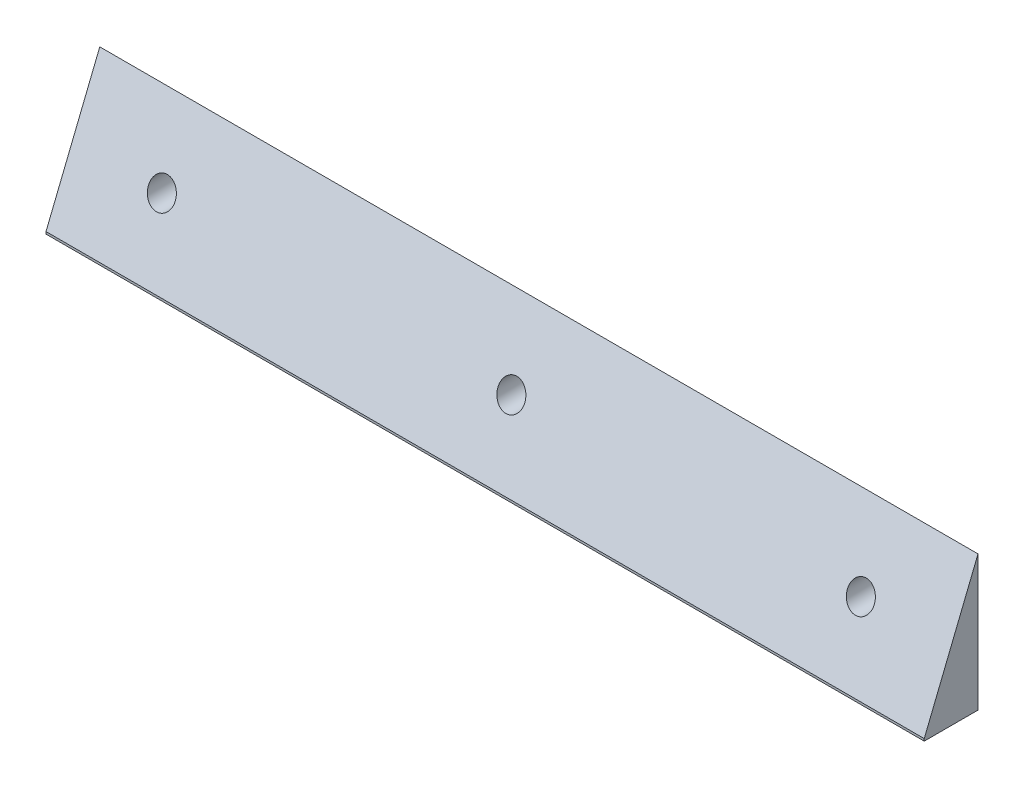
ISO-10303-21;
HEADER;
FILE_DESCRIPTION(('STEP AP214'),'2;1');
FILE_NAME('part.step','',(''),(''),'','','');
FILE_SCHEMA(('AUTOMOTIVE_DESIGN { 1 0 10303 214 1 1 1 1 }'));
ENDSEC;
DATA;
#1=APPLICATION_CONTEXT('core data for automotive mechanical design processes');
#2=APPLICATION_PROTOCOL_DEFINITION('international standard','automotive_design',2000,#1);
#3=PRODUCT_CONTEXT('',#1,'mechanical');
#4=PRODUCT('Part','Part','',(#3));
#5=PRODUCT_RELATED_PRODUCT_CATEGORY('part','',(#4));
#6=PRODUCT_DEFINITION_FORMATION('','',#4);
#7=PRODUCT_DEFINITION_CONTEXT('part definition',#1,'design');
#8=PRODUCT_DEFINITION('design','',#6,#7);
#9=PRODUCT_DEFINITION_SHAPE('','',#8);
#10=(LENGTH_UNIT() NAMED_UNIT(*) SI_UNIT(.MILLI.,.METRE.));
#11=(NAMED_UNIT(*) PLANE_ANGLE_UNIT() SI_UNIT($,.RADIAN.));
#12=(NAMED_UNIT(*) SI_UNIT($,.STERADIAN.) SOLID_ANGLE_UNIT());
#13=UNCERTAINTY_MEASURE_WITH_UNIT(LENGTH_MEASURE(1.E-05),#10,'distance_accuracy_value','');
#14=(GEOMETRIC_REPRESENTATION_CONTEXT(3) GLOBAL_UNCERTAINTY_ASSIGNED_CONTEXT((#13)) GLOBAL_UNIT_ASSIGNED_CONTEXT((#10,
#11,#12)) REPRESENTATION_CONTEXT('',''));
#15=CARTESIAN_POINT('',(0.,0.,0.));
#16=DIRECTION('',(0.,0.,1.));
#17=DIRECTION('',(1.,0.,0.));
#18=AXIS2_PLACEMENT_3D('',#15,#16,#17);
#19=CARTESIAN_POINT('',(0.,0.,6.));
#20=DIRECTION('',(1.,0.,0.));
#21=DIRECTION('',(0.,1.,0.));
#22=AXIS2_PLACEMENT_3D('',#19,#20,#21);
#23=PLANE('',#22);
#24=DIRECTION('',(0.,-1.,0.));
#25=VECTOR('',#24,1.);
#26=CARTESIAN_POINT('',(0.,0.,6.));
#27=LINE('',#26,#25);
#28=CARTESIAN_POINT('',(0.,-24.7508685341636,6.));
#29=VERTEX_POINT('',#28);
#30=CARTESIAN_POINT('',(0.,-25.,6.));
#31=VERTEX_POINT('',#30);
#32=EDGE_CURVE('E81',#29,#31,#27,.T.);
#33=ORIENTED_EDGE('',*,*,#32,.F.);
#34=DIRECTION('',(0.,0.927183854566789,-0.374606593415909));
#35=VECTOR('',#34,1.);
#36=CARTESIAN_POINT('',(0.,-24.7508685341636,6.));
#37=LINE('',#36,#35);
#38=CARTESIAN_POINT('',(0.,-9.90034741366571,0.));
#39=VERTEX_POINT('',#38);
#40=EDGE_CURVE('E64',#29,#39,#37,.T.);
#41=ORIENTED_EDGE('',*,*,#40,.T.);
#42=DIRECTION('',(0.,-1.,0.));
#43=VECTOR('',#42,1.);
#44=CARTESIAN_POINT('',(0.,0.,0.));
#45=LINE('',#44,#43);
#46=CARTESIAN_POINT('',(0.,-25.,0.));
#47=VERTEX_POINT('',#46);
#48=EDGE_CURVE('E103',#39,#47,#45,.T.);
#49=ORIENTED_EDGE('',*,*,#48,.T.);
#50=DIRECTION('',(0.,0.,-1.));
#51=VECTOR('',#50,1.);
#52=CARTESIAN_POINT('',(0.,-25.,6.));
#53=LINE('',#52,#51);
#54=EDGE_CURVE('E96',#31,#47,#53,.T.);
#55=ORIENTED_EDGE('',*,*,#54,.F.);
#56=EDGE_LOOP('',(#33,#41,#49,#55));
#57=FACE_BOUND('',#56,.T.);
#58=ADVANCED_FACE('F39',(#57),#23,.F.);
#59=CARTESIAN_POINT('',(0.,-25.,6.));
#60=DIRECTION('',(0.,1.,0.));
#61=DIRECTION('',(0.,0.,1.));
#62=AXIS2_PLACEMENT_3D('',#59,#60,#61);
#63=PLANE('',#62);
#64=DIRECTION('',(1.,0.,0.));
#65=VECTOR('',#64,1.);
#66=CARTESIAN_POINT('',(0.,-25.,0.));
#67=LINE('',#66,#65);
#68=CARTESIAN_POINT('',(98.,-25.,0.));
#69=VERTEX_POINT('',#68);
#70=EDGE_CURVE('E131',#47,#69,#67,.T.);
#71=ORIENTED_EDGE('',*,*,#70,.T.);
#72=DIRECTION('',(0.,0.,-1.));
#73=VECTOR('',#72,1.);
#74=CARTESIAN_POINT('',(98.,-25.,6.));
#75=LINE('',#74,#73);
#76=CARTESIAN_POINT('',(98.,-25.,6.));
#77=VERTEX_POINT('',#76);
#78=EDGE_CURVE('E98',#77,#69,#75,.T.);
#79=ORIENTED_EDGE('',*,*,#78,.F.);
#80=DIRECTION('',(1.,0.,0.));
#81=VECTOR('',#80,1.);
#82=CARTESIAN_POINT('',(0.,-25.,6.));
#83=LINE('',#82,#81);
#84=EDGE_CURVE('E85',#31,#77,#83,.T.);
#85=ORIENTED_EDGE('',*,*,#84,.F.);
#86=ORIENTED_EDGE('',*,*,#54,.T.);
#87=EDGE_LOOP('',(#71,#79,#85,#86));
#88=FACE_BOUND('',#87,.T.);
#89=ADVANCED_FACE('F95',(#88),#63,.F.);
#90=CARTESIAN_POINT('',(98.,0.,6.));
#91=DIRECTION('',(-1.,0.,0.));
#92=DIRECTION('',(0.,0.,1.));
#93=AXIS2_PLACEMENT_3D('',#90,#91,#92);
#94=PLANE('',#93);
#95=DIRECTION('',(0.,1.,0.));
#96=VECTOR('',#95,1.);
#97=CARTESIAN_POINT('',(98.,0.,0.));
#98=LINE('',#97,#96);
#99=CARTESIAN_POINT('',(98.,-9.90034741366571,0.));
#100=VERTEX_POINT('',#99);
#101=EDGE_CURVE('E91',#69,#100,#98,.T.);
#102=ORIENTED_EDGE('',*,*,#101,.T.);
#103=DIRECTION('',(0.,-0.927183854566789,0.374606593415909));
#104=VECTOR('',#103,1.);
#105=CARTESIAN_POINT('',(98.,-24.7508685341636,6.));
#106=LINE('',#105,#104);
#107=CARTESIAN_POINT('',(98.,-24.7508685341636,6.));
#108=VERTEX_POINT('',#107);
#109=EDGE_CURVE('E11',#100,#108,#106,.T.);
#110=ORIENTED_EDGE('',*,*,#109,.T.);
#111=DIRECTION('',(0.,1.,0.));
#112=VECTOR('',#111,1.);
#113=CARTESIAN_POINT('',(98.,0.,6.));
#114=LINE('',#113,#112);
#115=EDGE_CURVE('E101',#77,#108,#114,.T.);
#116=ORIENTED_EDGE('',*,*,#115,.F.);
#117=ORIENTED_EDGE('',*,*,#78,.T.);
#118=EDGE_LOOP('',(#102,#110,#116,#117));
#119=FACE_BOUND('',#118,.T.);
#120=ADVANCED_FACE('F139',(#119),#94,.F.);
#121=CARTESIAN_POINT('',(0.,0.,6.));
#122=DIRECTION('',(0.,0.,1.));
#123=DIRECTION('',(1.,0.,0.));
#124=AXIS2_PLACEMENT_3D('',#121,#122,#123);
#125=PLANE('',#124);
#126=ORIENTED_EDGE('',*,*,#115,.T.);
#127=DIRECTION('',(-1.,0.,0.));
#128=VECTOR('',#127,1.);
#129=CARTESIAN_POINT('',(0.,-24.7508685341636,6.));
#130=LINE('',#129,#128);
#131=EDGE_CURVE('E88',#108,#29,#130,.T.);
#132=ORIENTED_EDGE('',*,*,#131,.T.);
#133=ORIENTED_EDGE('',*,*,#32,.T.);
#134=ORIENTED_EDGE('',*,*,#84,.T.);
#135=EDGE_LOOP('',(#126,#132,#133,#134));
#136=FACE_BOUND('',#135,.T.);
#137=ADVANCED_FACE('F84',(#136),#125,.T.);
#138=CARTESIAN_POINT('',(0.,0.,0.));
#139=DIRECTION('',(0.,0.,1.));
#140=DIRECTION('',(1.,0.,0.));
#141=AXIS2_PLACEMENT_3D('',#138,#139,#140);
#142=PLANE('',#141);
#143=CARTESIAN_POINT('',(88.,-17.5,0.));
#144=DIRECTION('',(0.,0.,-1.));
#145=DIRECTION('',(-1.,0.,0.));
#146=AXIS2_PLACEMENT_3D('',#143,#144,#145);
#147=CIRCLE('',#146,1.5);
#148=CARTESIAN_POINT('',(86.5,-17.5,0.));
#149=VERTEX_POINT('',#148);
#150=EDGE_CURVE('E177',#149,#149,#147,.T.);
#151=ORIENTED_EDGE('',*,*,#150,.F.);
#152=EDGE_LOOP('',(#151));
#153=FACE_BOUND('',#152,.T.);
#154=CARTESIAN_POINT('',(10.,-17.5,0.));
#155=DIRECTION('',(0.,0.,-1.));
#156=DIRECTION('',(-1.,0.,0.));
#157=AXIS2_PLACEMENT_3D('',#154,#155,#156);
#158=CIRCLE('',#157,1.5);
#159=CARTESIAN_POINT('',(8.5,-17.5,0.));
#160=VERTEX_POINT('',#159);
#161=EDGE_CURVE('E174',#160,#160,#158,.T.);
#162=ORIENTED_EDGE('',*,*,#161,.F.);
#163=EDGE_LOOP('',(#162));
#164=FACE_BOUND('',#163,.T.);
#165=CARTESIAN_POINT('',(49.,-17.5,0.));
#166=DIRECTION('',(0.,0.,-1.));
#167=DIRECTION('',(-1.,0.,0.));
#168=AXIS2_PLACEMENT_3D('',#165,#166,#167);
#169=CIRCLE('',#168,1.5);
#170=CARTESIAN_POINT('',(47.5,-17.5,0.));
#171=VERTEX_POINT('',#170);
#172=EDGE_CURVE('E121',#171,#171,#169,.T.);
#173=ORIENTED_EDGE('',*,*,#172,.F.);
#174=EDGE_LOOP('',(#173));
#175=FACE_BOUND('',#174,.T.);
#176=ORIENTED_EDGE('',*,*,#48,.F.);
#177=DIRECTION('',(1.,0.,0.));
#178=VECTOR('',#177,1.);
#179=CARTESIAN_POINT('',(0.,-9.90034741366572,0.));
#180=LINE('',#179,#178);
#181=EDGE_CURVE('E49',#39,#100,#180,.T.);
#182=ORIENTED_EDGE('',*,*,#181,.T.);
#183=ORIENTED_EDGE('',*,*,#101,.F.);
#184=ORIENTED_EDGE('',*,*,#70,.F.);
#185=EDGE_LOOP('',(#176,#182,#183,#184));
#186=FACE_BOUND('',#185,.T.);
#187=ADVANCED_FACE('F143',(#153,#164,#175,#186),#142,.F.);
#188=CARTESIAN_POINT('',(0.,-24.7508685341636,6.));
#189=DIRECTION('',(0.,0.374606593415909,0.927183854566789));
#190=DIRECTION('',(1.,0.,0.));
#191=AXIS2_PLACEMENT_3D('',#188,#189,#190);
#192=PLANE('',#191);
#193=CARTESIAN_POINT('',(88.,-17.5,3.070458952115));
#194=DIRECTION('',(0.,0.374606593415909,0.927183854566789));
#195=DIRECTION('',(0.,0.927183854566789,-0.374606593415909));
#196=AXIS2_PLACEMENT_3D('',#193,#194,#195);
#197=ELLIPSE('',#196,1.61780211401637,1.5);
#198=CARTESIAN_POINT('',(88.,-16.,2.46441961336227));
#199=VERTEX_POINT('',#198);
#200=EDGE_CURVE('E43',#199,#199,#197,.T.);
#201=ORIENTED_EDGE('',*,*,#200,.F.);
#202=EDGE_LOOP('',(#201));
#203=FACE_BOUND('',#202,.T.);
#204=CARTESIAN_POINT('',(10.,-17.5,3.070458952115));
#205=DIRECTION('',(0.,0.374606593415909,0.927183854566789));
#206=DIRECTION('',(0.,0.927183854566789,-0.374606593415909));
#207=AXIS2_PLACEMENT_3D('',#204,#205,#206);
#208=ELLIPSE('',#207,1.61780211401637,1.5);
#209=CARTESIAN_POINT('',(10.,-16.,2.46441961336227));
#210=VERTEX_POINT('',#209);
#211=EDGE_CURVE('E120',#210,#210,#208,.T.);
#212=ORIENTED_EDGE('',*,*,#211,.F.);
#213=EDGE_LOOP('',(#212));
#214=FACE_BOUND('',#213,.T.);
#215=CARTESIAN_POINT('',(49.,-17.5,3.070458952115));
#216=DIRECTION('',(0.,0.374606593415909,0.927183854566789));
#217=DIRECTION('',(0.,0.927183854566789,-0.374606593415909));
#218=AXIS2_PLACEMENT_3D('',#215,#216,#217);
#219=ELLIPSE('',#218,1.61780211401638,1.5);
#220=CARTESIAN_POINT('',(49.,-16.,2.46441961336227));
#221=VERTEX_POINT('',#220);
#222=EDGE_CURVE('E117',#221,#221,#219,.T.);
#223=ORIENTED_EDGE('',*,*,#222,.F.);
#224=EDGE_LOOP('',(#223));
#225=FACE_BOUND('',#224,.T.);
#226=ORIENTED_EDGE('',*,*,#109,.F.);
#227=ORIENTED_EDGE('',*,*,#181,.F.);
#228=ORIENTED_EDGE('',*,*,#40,.F.);
#229=ORIENTED_EDGE('',*,*,#131,.F.);
#230=EDGE_LOOP('',(#226,#227,#228,#229));
#231=FACE_BOUND('',#230,.T.);
#232=ADVANCED_FACE('F41',(#203,#214,#225,#231),#192,.T.);
#233=CARTESIAN_POINT('',(49.,-17.5,6.));
#234=DIRECTION('',(0.,0.,-1.));
#235=DIRECTION('',(-1.,0.,0.));
#236=AXIS2_PLACEMENT_3D('',#233,#234,#235);
#237=CYLINDRICAL_SURFACE('',#236,1.5);
#238=ORIENTED_EDGE('',*,*,#222,.T.);
#239=EDGE_LOOP('',(#238));
#240=FACE_BOUND('',#239,.T.);
#241=ORIENTED_EDGE('',*,*,#172,.T.);
#242=EDGE_LOOP('',(#241));
#243=FACE_BOUND('',#242,.T.);
#244=ADVANCED_FACE('F142',(#240,#243),#237,.F.);
#245=CARTESIAN_POINT('',(10.,-17.5,6.));
#246=DIRECTION('',(0.,0.,-1.));
#247=DIRECTION('',(-1.,0.,0.));
#248=AXIS2_PLACEMENT_3D('',#245,#246,#247);
#249=CYLINDRICAL_SURFACE('',#248,1.5);
#250=ORIENTED_EDGE('',*,*,#211,.T.);
#251=EDGE_LOOP('',(#250));
#252=FACE_BOUND('',#251,.T.);
#253=ORIENTED_EDGE('',*,*,#161,.T.);
#254=EDGE_LOOP('',(#253));
#255=FACE_BOUND('',#254,.T.);
#256=ADVANCED_FACE('F149',(#252,#255),#249,.F.);
#257=CARTESIAN_POINT('',(88.,-17.5,6.));
#258=DIRECTION('',(0.,0.,-1.));
#259=DIRECTION('',(-1.,0.,0.));
#260=AXIS2_PLACEMENT_3D('',#257,#258,#259);
#261=CYLINDRICAL_SURFACE('',#260,1.5);
#262=ORIENTED_EDGE('',*,*,#200,.T.);
#263=EDGE_LOOP('',(#262));
#264=FACE_BOUND('',#263,.T.);
#265=ORIENTED_EDGE('',*,*,#150,.T.);
#266=EDGE_LOOP('',(#265));
#267=FACE_BOUND('',#266,.T.);
#268=ADVANCED_FACE('F165',(#264,#267),#261,.F.);
#269=CLOSED_SHELL('',(#58,#89,#120,#137,#187,#232,#244,#256,#268));
#270=MANIFOLD_SOLID_BREP('B2',#269);
#271=ADVANCED_BREP_SHAPE_REPRESENTATION('',(#18,#270),#14);
#272=SHAPE_DEFINITION_REPRESENTATION(#9,#271);
ENDSEC;
END-ISO-10303-21;
